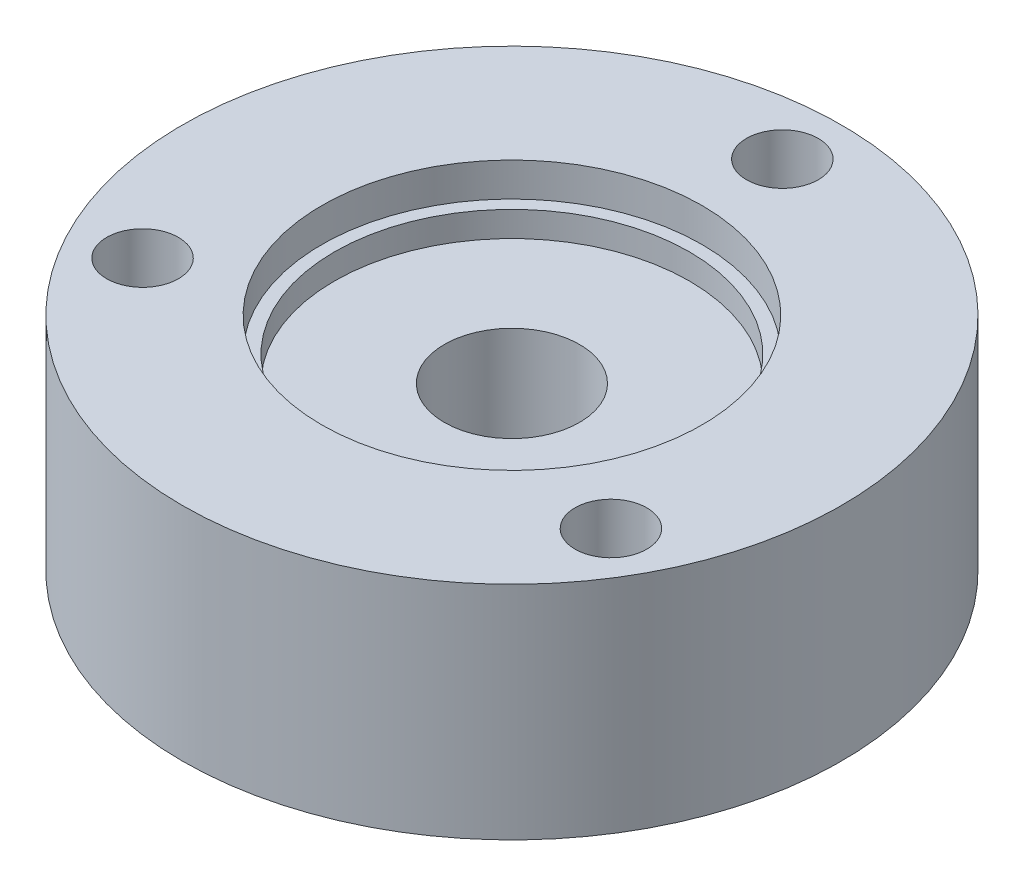
ISO-10303-21;
HEADER;
FILE_DESCRIPTION(('STEP AP214'),'2;1');
FILE_NAME('part.step','',(''),(''),'','','');
FILE_SCHEMA(('AUTOMOTIVE_DESIGN { 1 0 10303 214 1 1 1 1 }'));
ENDSEC;
DATA;
#1=APPLICATION_CONTEXT('core data for automotive mechanical design processes');
#2=APPLICATION_PROTOCOL_DEFINITION('international standard','automotive_design',2000,#1);
#3=PRODUCT_CONTEXT('',#1,'mechanical');
#4=PRODUCT('Part','Part','',(#3));
#5=PRODUCT_RELATED_PRODUCT_CATEGORY('part','',(#4));
#6=PRODUCT_DEFINITION_FORMATION('','',#4);
#7=PRODUCT_DEFINITION_CONTEXT('part definition',#1,'design');
#8=PRODUCT_DEFINITION('design','',#6,#7);
#9=PRODUCT_DEFINITION_SHAPE('','',#8);
#10=(LENGTH_UNIT() NAMED_UNIT(*) SI_UNIT(.MILLI.,.METRE.));
#11=(NAMED_UNIT(*) PLANE_ANGLE_UNIT() SI_UNIT($,.RADIAN.));
#12=(NAMED_UNIT(*) SI_UNIT($,.STERADIAN.) SOLID_ANGLE_UNIT());
#13=UNCERTAINTY_MEASURE_WITH_UNIT(LENGTH_MEASURE(1.E-05),#10,'distance_accuracy_value','');
#14=(GEOMETRIC_REPRESENTATION_CONTEXT(3) GLOBAL_UNCERTAINTY_ASSIGNED_CONTEXT((#13)) GLOBAL_UNIT_ASSIGNED_CONTEXT((#10,
#11,#12)) REPRESENTATION_CONTEXT('',''));
#15=CARTESIAN_POINT('',(0.,0.,0.));
#16=DIRECTION('',(0.,0.,1.));
#17=DIRECTION('',(1.,0.,0.));
#18=AXIS2_PLACEMENT_3D('',#15,#16,#17);
#19=CARTESIAN_POINT('',(0.,-3.175,0.));
#20=DIRECTION('',(0.,1.,0.));
#21=DIRECTION('',(0.,0.,1.));
#22=AXIS2_PLACEMENT_3D('',#19,#20,#21);
#23=CYLINDRICAL_SURFACE('',#22,33.3375);
#24=CARTESIAN_POINT('',(0.,-3.175,0.));
#25=DIRECTION('',(0.,1.,0.));
#26=DIRECTION('',(0.,0.,1.));
#27=AXIS2_PLACEMENT_3D('',#24,#25,#26);
#28=CIRCLE('',#27,33.3375);
#29=CARTESIAN_POINT('',(0.,-3.175,33.3375));
#30=VERTEX_POINT('',#29);
#31=EDGE_CURVE('E44',#30,#30,#28,.T.);
#32=ORIENTED_EDGE('',*,*,#31,.F.);
#33=EDGE_LOOP('',(#32));
#34=FACE_BOUND('',#33,.T.);
#35=CARTESIAN_POINT('',(0.,1.5748,0.));
#36=DIRECTION('',(0.,1.,0.));
#37=DIRECTION('',(0.,0.,1.));
#38=AXIS2_PLACEMENT_3D('',#35,#36,#37);
#39=CIRCLE('',#38,33.3375);
#40=CARTESIAN_POINT('',(0.,1.5748,33.3375));
#41=VERTEX_POINT('',#40);
#42=EDGE_CURVE('E48',#41,#41,#39,.F.);
#43=ORIENTED_EDGE('',*,*,#42,.F.);
#44=EDGE_LOOP('',(#43));
#45=FACE_BOUND('',#44,.T.);
#46=ADVANCED_FACE('F31',(#34,#45),#23,.F.);
#47=CARTESIAN_POINT('',(0.,-3.175,0.));
#48=DIRECTION('',(0.,1.,0.));
#49=DIRECTION('',(0.,0.,1.));
#50=AXIS2_PLACEMENT_3D('',#47,#48,#49);
#51=PLANE('',#50);
#52=CARTESIAN_POINT('',(0.,-3.175,0.));
#53=DIRECTION('',(0.,1.,0.));
#54=DIRECTION('',(0.,0.,1.));
#55=AXIS2_PLACEMENT_3D('',#52,#53,#54);
#56=CIRCLE('',#55,12.7);
#57=CARTESIAN_POINT('',(0.,-3.175,12.7));
#58=VERTEX_POINT('',#57);
#59=EDGE_CURVE('E73',#58,#58,#56,.T.);
#60=ORIENTED_EDGE('',*,*,#59,.F.);
#61=EDGE_LOOP('',(#60));
#62=FACE_BOUND('',#61,.T.);
#63=ORIENTED_EDGE('',*,*,#31,.T.);
#64=EDGE_LOOP('',(#63));
#65=FACE_BOUND('',#64,.T.);
#66=ADVANCED_FACE('F83',(#62,#65),#51,.T.);
#67=CARTESIAN_POINT('',(0.,1.5748,0.));
#68=DIRECTION('',(0.,1.,0.));
#69=DIRECTION('',(0.,0.,1.));
#70=AXIS2_PLACEMENT_3D('',#67,#68,#69);
#71=PLANE('',#70);
#72=CARTESIAN_POINT('',(0.,1.5748,0.));
#73=DIRECTION('',(0.,1.,0.));
#74=DIRECTION('',(0.,0.,1.));
#75=AXIS2_PLACEMENT_3D('',#72,#73,#74);
#76=CIRCLE('',#75,35.7124);
#77=CARTESIAN_POINT('',(0.,1.5748,35.7124));
#78=VERTEX_POINT('',#77);
#79=EDGE_CURVE('E51',#78,#78,#76,.T.);
#80=ORIENTED_EDGE('',*,*,#79,.T.);
#81=EDGE_LOOP('',(#80));
#82=FACE_BOUND('',#81,.T.);
#83=ORIENTED_EDGE('',*,*,#42,.T.);
#84=EDGE_LOOP('',(#83));
#85=FACE_BOUND('',#84,.T.);
#86=ADVANCED_FACE('F90',(#82,#85),#71,.T.);
#87=CARTESIAN_POINT('',(0.,1.5748,0.));
#88=DIRECTION('',(0.,1.,0.));
#89=DIRECTION('',(0.,0.,1.));
#90=AXIS2_PLACEMENT_3D('',#87,#88,#89);
#91=CYLINDRICAL_SURFACE('',#90,35.7124);
#92=ORIENTED_EDGE('',*,*,#79,.F.);
#93=EDGE_LOOP('',(#92));
#94=FACE_BOUND('',#93,.T.);
#95=CARTESIAN_POINT('',(0.,7.9248,0.));
#96=DIRECTION('',(0.,1.,0.));
#97=DIRECTION('',(0.,0.,1.));
#98=AXIS2_PLACEMENT_3D('',#95,#96,#97);
#99=CIRCLE('',#98,35.7124);
#100=CARTESIAN_POINT('',(0.,7.9248,35.7124));
#101=VERTEX_POINT('',#100);
#102=EDGE_CURVE('E76',#101,#101,#99,.T.);
#103=ORIENTED_EDGE('',*,*,#102,.T.);
#104=EDGE_LOOP('',(#103));
#105=FACE_BOUND('',#104,.T.);
#106=ADVANCED_FACE('F92',(#94,#105),#91,.F.);
#107=CARTESIAN_POINT('',(0.,7.9248,0.));
#108=DIRECTION('',(0.,-1.,0.));
#109=DIRECTION('',(0.,0.,-1.));
#110=AXIS2_PLACEMENT_3D('',#107,#108,#109);
#111=CYLINDRICAL_SURFACE('',#110,61.9125);
#112=CARTESIAN_POINT('',(0.,7.9248,0.));
#113=DIRECTION('',(0.,1.,0.));
#114=DIRECTION('',(0.,0.,1.));
#115=AXIS2_PLACEMENT_3D('',#112,#113,#114);
#116=CIRCLE('',#115,61.9125);
#117=CARTESIAN_POINT('',(0.,7.9248,61.9125));
#118=VERTEX_POINT('',#117);
#119=EDGE_CURVE('E10',#118,#118,#116,.T.);
#120=ORIENTED_EDGE('',*,*,#119,.F.);
#121=EDGE_LOOP('',(#120));
#122=FACE_BOUND('',#121,.T.);
#123=CARTESIAN_POINT('',(0.,-33.6677,0.));
#124=DIRECTION('',(0.,1.,0.));
#125=DIRECTION('',(0.,0.,1.));
#126=AXIS2_PLACEMENT_3D('',#123,#124,#125);
#127=CIRCLE('',#126,61.9125);
#128=CARTESIAN_POINT('',(0.,-33.6677,61.9125));
#129=VERTEX_POINT('',#128);
#130=EDGE_CURVE('E39',#129,#129,#127,.T.);
#131=ORIENTED_EDGE('',*,*,#130,.T.);
#132=EDGE_LOOP('',(#131));
#133=FACE_BOUND('',#132,.T.);
#134=ADVANCED_FACE('F33',(#122,#133),#111,.T.);
#135=CARTESIAN_POINT('',(0.,7.9248,0.));
#136=DIRECTION('',(0.,1.,0.));
#137=DIRECTION('',(0.,0.,1.));
#138=AXIS2_PLACEMENT_3D('',#135,#136,#137);
#139=PLANE('',#138);
#140=CARTESIAN_POINT('',(-43.99409051225,7.9248,25.3999999999991));
#141=DIRECTION('',(0.,1.,0.));
#142=DIRECTION('',(0.,0.,1.));
#143=AXIS2_PLACEMENT_3D('',#140,#141,#142);
#144=CIRCLE('',#143,6.74369999999991);
#145=CARTESIAN_POINT('',(-43.99409051225,7.9248,32.143699999999));
#146=VERTEX_POINT('',#145);
#147=EDGE_CURVE('E68',#146,#146,#144,.T.);
#148=ORIENTED_EDGE('',*,*,#147,.F.);
#149=EDGE_LOOP('',(#148));
#150=FACE_BOUND('',#149,.T.);
#151=CARTESIAN_POINT('',(43.994090512249,7.9248,25.3999999999997));
#152=DIRECTION('',(0.,1.,0.));
#153=DIRECTION('',(0.,0.,1.));
#154=AXIS2_PLACEMENT_3D('',#151,#152,#153);
#155=CIRCLE('',#154,6.74369999999996);
#156=CARTESIAN_POINT('',(43.994090512249,7.9248,32.1436999999996));
#157=VERTEX_POINT('',#156);
#158=EDGE_CURVE('E58',#157,#157,#155,.T.);
#159=ORIENTED_EDGE('',*,*,#158,.F.);
#160=EDGE_LOOP('',(#159));
#161=FACE_BOUND('',#160,.T.);
#162=CARTESIAN_POINT('',(0.,7.9248,-50.8000000000007));
#163=DIRECTION('',(0.,1.,0.));
#164=DIRECTION('',(0.,0.,1.));
#165=AXIS2_PLACEMENT_3D('',#162,#163,#164);
#166=CIRCLE('',#165,6.74370000000004);
#167=CARTESIAN_POINT('',(0.,7.9248,-44.0563000000007));
#168=VERTEX_POINT('',#167);
#169=EDGE_CURVE('E55',#168,#168,#166,.T.);
#170=ORIENTED_EDGE('',*,*,#169,.F.);
#171=EDGE_LOOP('',(#170));
#172=FACE_BOUND('',#171,.T.);
#173=ORIENTED_EDGE('',*,*,#102,.F.);
#174=EDGE_LOOP('',(#173));
#175=FACE_BOUND('',#174,.T.);
#176=ORIENTED_EDGE('',*,*,#119,.T.);
#177=EDGE_LOOP('',(#176));
#178=FACE_BOUND('',#177,.T.);
#179=ADVANCED_FACE('F109',(#150,#161,#172,#175,#178),#139,.T.);
#180=CARTESIAN_POINT('',(0.,-33.6677,0.));
#181=DIRECTION('',(0.,1.,0.));
#182=DIRECTION('',(0.,0.,1.));
#183=AXIS2_PLACEMENT_3D('',#180,#181,#182);
#184=PLANE('',#183);
#185=CARTESIAN_POINT('',(-43.99409051225,-33.6677,25.3999999999991));
#186=DIRECTION('',(0.,1.,0.));
#187=DIRECTION('',(0.,0.,1.));
#188=AXIS2_PLACEMENT_3D('',#185,#186,#187);
#189=CIRCLE('',#188,6.74369999999991);
#190=CARTESIAN_POINT('',(-43.99409051225,-33.6677,32.143699999999));
#191=VERTEX_POINT('',#190);
#192=EDGE_CURVE('E35',#191,#191,#189,.T.);
#193=ORIENTED_EDGE('',*,*,#192,.T.);
#194=EDGE_LOOP('',(#193));
#195=FACE_BOUND('',#194,.T.);
#196=CARTESIAN_POINT('',(43.994090512249,-33.6677,25.3999999999997));
#197=DIRECTION('',(0.,1.,0.));
#198=DIRECTION('',(0.,0.,1.));
#199=AXIS2_PLACEMENT_3D('',#196,#197,#198);
#200=CIRCLE('',#199,6.74369999999996);
#201=CARTESIAN_POINT('',(43.994090512249,-33.6677,32.1436999999996));
#202=VERTEX_POINT('',#201);
#203=EDGE_CURVE('E56',#202,#202,#200,.T.);
#204=ORIENTED_EDGE('',*,*,#203,.T.);
#205=EDGE_LOOP('',(#204));
#206=FACE_BOUND('',#205,.T.);
#207=CARTESIAN_POINT('',(0.,-33.6677,-50.8000000000007));
#208=DIRECTION('',(0.,1.,0.));
#209=DIRECTION('',(0.,0.,1.));
#210=AXIS2_PLACEMENT_3D('',#207,#208,#209);
#211=CIRCLE('',#210,6.74370000000004);
#212=CARTESIAN_POINT('',(0.,-33.6677,-44.0563000000007));
#213=VERTEX_POINT('',#212);
#214=EDGE_CURVE('E52',#213,#213,#211,.T.);
#215=ORIENTED_EDGE('',*,*,#214,.T.);
#216=EDGE_LOOP('',(#215));
#217=FACE_BOUND('',#216,.T.);
#218=CARTESIAN_POINT('',(0.,-33.6677,0.));
#219=DIRECTION('',(0.,1.,0.));
#220=DIRECTION('',(0.,0.,1.));
#221=AXIS2_PLACEMENT_3D('',#218,#219,#220);
#222=CIRCLE('',#221,12.7);
#223=CARTESIAN_POINT('',(0.,-33.6677,12.7));
#224=VERTEX_POINT('',#223);
#225=EDGE_CURVE('E54',#224,#224,#222,.T.);
#226=ORIENTED_EDGE('',*,*,#225,.T.);
#227=EDGE_LOOP('',(#226));
#228=FACE_BOUND('',#227,.T.);
#229=ORIENTED_EDGE('',*,*,#130,.F.);
#230=EDGE_LOOP('',(#229));
#231=FACE_BOUND('',#230,.T.);
#232=ADVANCED_FACE('F107',(#195,#206,#217,#228,#231),#184,.F.);
#233=CARTESIAN_POINT('',(0.,-33.6677,0.));
#234=DIRECTION('',(0.,1.,0.));
#235=DIRECTION('',(0.,0.,1.));
#236=AXIS2_PLACEMENT_3D('',#233,#234,#235);
#237=CYLINDRICAL_SURFACE('',#236,12.7);
#238=ORIENTED_EDGE('',*,*,#59,.T.);
#239=EDGE_LOOP('',(#238));
#240=FACE_BOUND('',#239,.T.);
#241=ORIENTED_EDGE('',*,*,#225,.F.);
#242=EDGE_LOOP('',(#241));
#243=FACE_BOUND('',#242,.T.);
#244=ADVANCED_FACE('F104',(#240,#243),#237,.F.);
#245=CARTESIAN_POINT('',(0.,-37.7952,-50.8000000000007));
#246=DIRECTION('',(0.,1.,0.));
#247=DIRECTION('',(0.,0.,1.));
#248=AXIS2_PLACEMENT_3D('',#245,#246,#247);
#249=CYLINDRICAL_SURFACE('',#248,6.74370000000004);
#250=ORIENTED_EDGE('',*,*,#169,.T.);
#251=EDGE_LOOP('',(#250));
#252=FACE_BOUND('',#251,.T.);
#253=ORIENTED_EDGE('',*,*,#214,.F.);
#254=EDGE_LOOP('',(#253));
#255=FACE_BOUND('',#254,.T.);
#256=ADVANCED_FACE('F126',(#252,#255),#249,.F.);
#257=CARTESIAN_POINT('',(43.994090512249,-37.7952,25.3999999999997));
#258=DIRECTION('',(0.,1.,0.));
#259=DIRECTION('',(0.,0.,1.));
#260=AXIS2_PLACEMENT_3D('',#257,#258,#259);
#261=CYLINDRICAL_SURFACE('',#260,6.74369999999996);
#262=ORIENTED_EDGE('',*,*,#158,.T.);
#263=EDGE_LOOP('',(#262));
#264=FACE_BOUND('',#263,.T.);
#265=ORIENTED_EDGE('',*,*,#203,.F.);
#266=EDGE_LOOP('',(#265));
#267=FACE_BOUND('',#266,.T.);
#268=ADVANCED_FACE('F129',(#264,#267),#261,.F.);
#269=CARTESIAN_POINT('',(-43.99409051225,-37.7952,25.3999999999991));
#270=DIRECTION('',(0.,1.,0.));
#271=DIRECTION('',(0.,0.,1.));
#272=AXIS2_PLACEMENT_3D('',#269,#270,#271);
#273=CYLINDRICAL_SURFACE('',#272,6.74369999999991);
#274=ORIENTED_EDGE('',*,*,#147,.T.);
#275=EDGE_LOOP('',(#274));
#276=FACE_BOUND('',#275,.T.);
#277=ORIENTED_EDGE('',*,*,#192,.F.);
#278=EDGE_LOOP('',(#277));
#279=FACE_BOUND('',#278,.T.);
#280=ADVANCED_FACE('F156',(#276,#279),#273,.F.);
#281=CLOSED_SHELL('',(#46,#66,#86,#106,#134,#179,#232,#244,#256,#268,#280));
#282=MANIFOLD_SOLID_BREP('B2',#281);
#283=ADVANCED_BREP_SHAPE_REPRESENTATION('',(#18,#282),#14);
#284=SHAPE_DEFINITION_REPRESENTATION(#9,#283);
ENDSEC;
END-ISO-10303-21;
